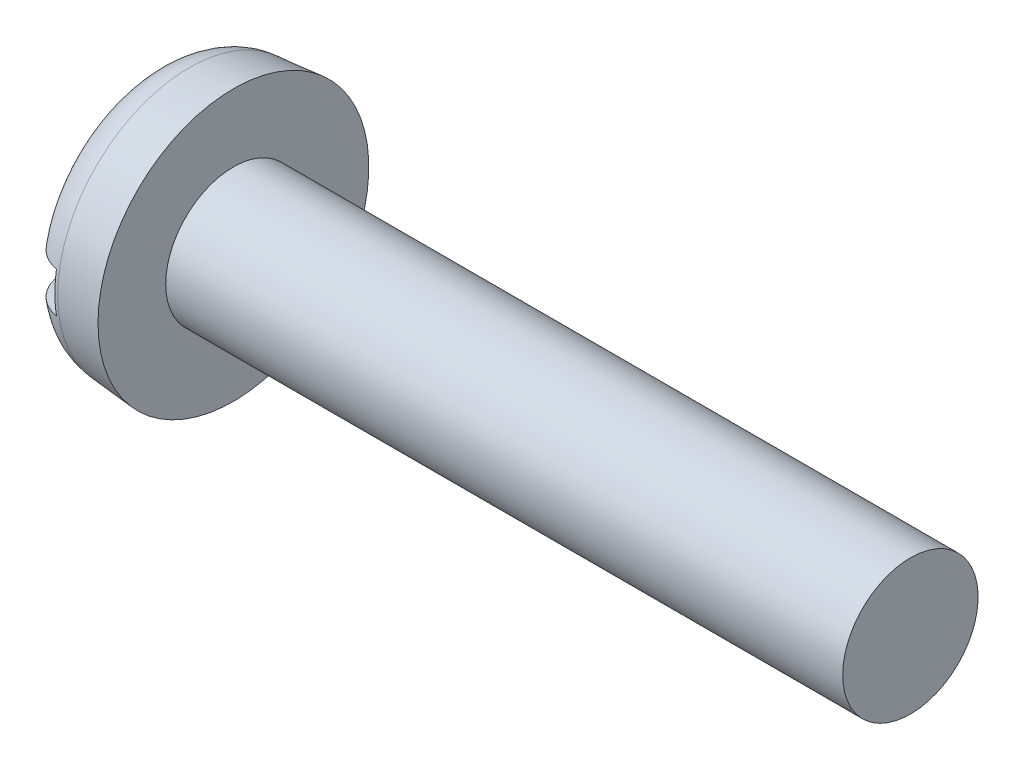
ISO-10303-21;
HEADER;
FILE_DESCRIPTION(('STEP AP214'),'2;1');
FILE_NAME('part.step','',(''),(''),'','','');
FILE_SCHEMA(('AUTOMOTIVE_DESIGN { 1 0 10303 214 1 1 1 1 }'));
ENDSEC;
DATA;
#1=APPLICATION_CONTEXT('core data for automotive mechanical design processes');
#2=APPLICATION_PROTOCOL_DEFINITION('international standard','automotive_design',2000,#1);
#3=PRODUCT_CONTEXT('',#1,'mechanical');
#4=PRODUCT('Part','Part','',(#3));
#5=PRODUCT_RELATED_PRODUCT_CATEGORY('part','',(#4));
#6=PRODUCT_DEFINITION_FORMATION('','',#4);
#7=PRODUCT_DEFINITION_CONTEXT('part definition',#1,'design');
#8=PRODUCT_DEFINITION('design','',#6,#7);
#9=PRODUCT_DEFINITION_SHAPE('','',#8);
#10=(LENGTH_UNIT() NAMED_UNIT(*) SI_UNIT(.MILLI.,.METRE.));
#11=(NAMED_UNIT(*) PLANE_ANGLE_UNIT() SI_UNIT($,.RADIAN.));
#12=(NAMED_UNIT(*) SI_UNIT($,.STERADIAN.) SOLID_ANGLE_UNIT());
#13=UNCERTAINTY_MEASURE_WITH_UNIT(LENGTH_MEASURE(1.E-05),#10,'distance_accuracy_value','');
#14=(GEOMETRIC_REPRESENTATION_CONTEXT(3) GLOBAL_UNCERTAINTY_ASSIGNED_CONTEXT((#13)) GLOBAL_UNIT_ASSIGNED_CONTEXT((#10,
#11,#12)) REPRESENTATION_CONTEXT('',''));
#15=CARTESIAN_POINT('',(0.,0.,0.));
#16=DIRECTION('',(0.,0.,1.));
#17=DIRECTION('',(1.,0.,0.));
#18=AXIS2_PLACEMENT_3D('',#15,#16,#17);
#19=CARTESIAN_POINT('',(0.,0.,0.));
#20=DIRECTION('',(-1.,0.,0.));
#21=DIRECTION('',(0.,0.,1.));
#22=AXIS2_PLACEMENT_3D('',#19,#20,#21);
#23=PLANE('',#22);
#24=DIRECTION('',(0.,0.,-1.));
#25=VECTOR('',#24,1.);
#26=CARTESIAN_POINT('',(0.,0.599999999999999,4.));
#27=LINE('',#26,#25);
#28=CARTESIAN_POINT('',(0.,0.599999999999999,2.62267277825956));
#29=VERTEX_POINT('',#28);
#30=CARTESIAN_POINT('',(0.,0.599999999999999,-2.62267277825956));
#31=VERTEX_POINT('',#30);
#32=EDGE_CURVE('E90',#29,#31,#27,.T.);
#33=ORIENTED_EDGE('',*,*,#32,.F.);
#34=CARTESIAN_POINT('',(0.,0.,0.));
#35=DIRECTION('',(-1.,0.,0.));
#36=DIRECTION('',(0.,0.,1.));
#37=AXIS2_PLACEMENT_3D('',#34,#35,#36);
#38=CIRCLE('',#37,2.69042979871687);
#39=EDGE_CURVE('E96',#29,#31,#38,.T.);
#40=ORIENTED_EDGE('',*,*,#39,.T.);
#41=EDGE_LOOP('',(#33,#40));
#42=FACE_BOUND('',#41,.T.);
#43=ADVANCED_FACE('F37',(#42),#23,.T.);
#44=CARTESIAN_POINT('',(-25.4,0.,0.));
#45=DIRECTION('',(-1.,0.,0.));
#46=DIRECTION('',(0.,0.,1.));
#47=AXIS2_PLACEMENT_3D('',#44,#45,#46);
#48=CYLINDRICAL_SURFACE('',#47,2.);
#49=CARTESIAN_POINT('',(22.4,0.,0.));
#50=DIRECTION('',(-1.,0.,0.));
#51=DIRECTION('',(0.,0.,1.));
#52=AXIS2_PLACEMENT_3D('',#49,#50,#51);
#53=CIRCLE('',#52,2.);
#54=CARTESIAN_POINT('',(22.4,0.,2.));
#55=VERTEX_POINT('',#54);
#56=EDGE_CURVE('E97',#55,#55,#53,.T.);
#57=ORIENTED_EDGE('',*,*,#56,.T.);
#58=EDGE_LOOP('',(#57));
#59=FACE_BOUND('',#58,.T.);
#60=CARTESIAN_POINT('',(2.4,0.,0.));
#61=DIRECTION('',(-1.,0.,0.));
#62=DIRECTION('',(0.,0.,1.));
#63=AXIS2_PLACEMENT_3D('',#60,#61,#62);
#64=CIRCLE('',#63,2.);
#65=CARTESIAN_POINT('',(2.4,0.,2.));
#66=VERTEX_POINT('',#65);
#67=EDGE_CURVE('E154',#66,#66,#64,.T.);
#68=ORIENTED_EDGE('',*,*,#67,.F.);
#69=EDGE_LOOP('',(#68));
#70=FACE_BOUND('',#69,.T.);
#71=ADVANCED_FACE('F142',(#59,#70),#48,.T.);
#72=CARTESIAN_POINT('',(22.4,2.,0.));
#73=DIRECTION('',(1.,0.,0.));
#74=DIRECTION('',(0.,0.,-1.));
#75=AXIS2_PLACEMENT_3D('',#72,#73,#74);
#76=PLANE('',#75);
#77=ORIENTED_EDGE('',*,*,#56,.F.);
#78=EDGE_LOOP('',(#77));
#79=FACE_BOUND('',#78,.T.);
#80=ADVANCED_FACE('F140',(#79),#76,.T.);
#81=DIRECTION('',(0.,0.,1.));
#82=VECTOR('',#81,1.);
#83=CARTESIAN_POINT('',(0.,-0.599999999999999,-4.));
#84=LINE('',#83,#82);
#85=CARTESIAN_POINT('',(0.,-0.6,-2.62267277825956));
#86=VERTEX_POINT('',#85);
#87=CARTESIAN_POINT('',(0.,-0.6,2.62267277825956));
#88=VERTEX_POINT('',#87);
#89=EDGE_CURVE('E81',#86,#88,#84,.T.);
#90=ORIENTED_EDGE('',*,*,#89,.F.);
#91=EDGE_CURVE('E88',#86,#88,#38,.T.);
#92=ORIENTED_EDGE('',*,*,#91,.T.);
#93=EDGE_LOOP('',(#90,#92));
#94=FACE_BOUND('',#93,.T.);
#95=ADVANCED_FACE('F87',(#94),#23,.T.);
#96=CARTESIAN_POINT('',(0.,0.,0.));
#97=DIRECTION('',(1.,0.,0.));
#98=DIRECTION('',(0.,0.,-1.));
#99=AXIS2_PLACEMENT_3D('',#96,#97,#98);
#100=CONICAL_SURFACE('',#99,3.79002720753778,0.0872664625997168);
#101=CARTESIAN_POINT('',(1.09541310870281,0.,0.));
#102=DIRECTION('',(-1.,0.,0.));
#103=DIRECTION('',(0.,0.,1.));
#104=AXIS2_PLACEMENT_3D('',#101,#102,#103);
#105=CIRCLE('',#104,3.88586343642697);
#106=CARTESIAN_POINT('',(1.09541310870281,0.,3.88586343642697));
#107=VERTEX_POINT('',#106);
#108=EDGE_CURVE('E100',#107,#107,#105,.F.);
#109=ORIENTED_EDGE('',*,*,#108,.T.);
#110=EDGE_LOOP('',(#109));
#111=FACE_BOUND('',#110,.T.);
#112=CARTESIAN_POINT('',(2.4,0.,0.));
#113=DIRECTION('',(-1.,0.,0.));
#114=DIRECTION('',(0.,0.,1.));
#115=AXIS2_PLACEMENT_3D('',#112,#113,#114);
#116=CIRCLE('',#115,4.);
#117=CARTESIAN_POINT('',(2.4,0.,4.));
#118=VERTEX_POINT('',#117);
#119=EDGE_CURVE('E102',#118,#118,#116,.T.);
#120=ORIENTED_EDGE('',*,*,#119,.T.);
#121=EDGE_LOOP('',(#120));
#122=FACE_BOUND('',#121,.T.);
#123=ADVANCED_FACE('F133',(#111,#122),#100,.T.);
#124=CARTESIAN_POINT('',(2.4,2.,0.));
#125=DIRECTION('',(-1.,0.,0.));
#126=DIRECTION('',(0.,0.,1.));
#127=AXIS2_PLACEMENT_3D('',#124,#125,#126);
#128=PLANE('',#127);
#129=ORIENTED_EDGE('',*,*,#119,.F.);
#130=EDGE_LOOP('',(#129));
#131=FACE_BOUND('',#130,.T.);
#132=ORIENTED_EDGE('',*,*,#67,.T.);
#133=EDGE_LOOP('',(#132));
#134=FACE_BOUND('',#133,.T.);
#135=ADVANCED_FACE('F129',(#131,#134),#128,.F.);
#136=CARTESIAN_POINT('',(1.2,0.,0.));
#137=DIRECTION('',(-1.,0.,0.));
#138=DIRECTION('',(0.,0.,1.));
#139=AXIS2_PLACEMENT_3D('',#136,#137,#138);
#140=TOROIDAL_SURFACE('',#139,2.69042979871687,1.2);
#141=CARTESIAN_POINT('',(0.555724322716202,0.599999999999999,-3.65387250266693));
#142=CARTESIAN_POINT('',(0.611863503349148,0.599999999999999,-3.69007442380863));
#143=CARTESIAN_POINT('',(0.671083729036184,0.599999999999999,-3.72158508732967));
#144=CARTESIAN_POINT('',(0.79401889727098,0.599999999999999,-3.77425118606527));
#145=CARTESIAN_POINT('',(0.85773880813834,0.599999999999999,-3.79539496352661));
#146=CARTESIAN_POINT('',(0.98781720318935,0.599999999999999,-3.82665867013959));
#147=CARTESIAN_POINT('',(1.05417498163634,0.599999999999999,-3.83678152753281));
#148=CARTESIAN_POINT('',(1.18763076317312,0.599999999999999,-3.8457038749108));
#149=CARTESIAN_POINT('',(1.25472858753784,0.599999999999999,-3.84450604157818));
#150=CARTESIAN_POINT('',(1.3875826750597,0.599999999999999,-3.83084960648641));
#151=CARTESIAN_POINT('',(1.45334209482657,0.599999999999999,-3.81842168881049));
#152=CARTESIAN_POINT('',(1.58184721835929,0.599999999999999,-3.78271705011504));
#153=CARTESIAN_POINT('',(1.64459283097848,0.599999999999999,-3.75944000121253));
#154=CARTESIAN_POINT('',(1.76539749147003,0.599999999999999,-3.70268381719218));
#155=CARTESIAN_POINT('',(1.82344949533768,0.599999999999999,-3.66918969543344));
#156=CARTESIAN_POINT('',(1.93315741055135,0.599999999999999,-3.59299631395384));
#157=CARTESIAN_POINT('',(1.98481318571468,0.599999999999999,-3.55029685829444));
#158=CARTESIAN_POINT('',(2.08067865855225,0.599999999999999,-3.45659366392883));
#159=CARTESIAN_POINT('',(2.12483195353351,0.599999999999999,-3.40553224175404));
#160=CARTESIAN_POINT('',(2.20406927284653,0.599999999999999,-3.2968041503142));
#161=CARTESIAN_POINT('',(2.23915285291393,0.599999999999999,-3.23913715768625));
#162=CARTESIAN_POINT('',(2.29977245801882,0.599999999999999,-3.11803251672383));
#163=CARTESIAN_POINT('',(2.32517621704533,0.599999999999999,-3.0545286928096));
#164=CARTESIAN_POINT('',(2.36518290369176,0.599999999999999,-2.92420898188477));
#165=CARTESIAN_POINT('',(2.37978492313438,0.599999999999999,-2.85739281688645));
#166=CARTESIAN_POINT('',(2.39809162762938,0.599999999999999,-2.720979108425));
#167=CARTESIAN_POINT('',(2.40158167515656,0.599999999999999,-2.65135279312089));
#168=CARTESIAN_POINT('',(2.39710334710588,0.599999999999999,-2.51247199114133));
#169=CARTESIAN_POINT('',(2.3891336132547,0.599999999999999,-2.44321754951888));
#170=CARTESIAN_POINT('',(2.36175648802687,0.599999999999999,-2.30533307084818));
#171=CARTESIAN_POINT('',(2.34208762383128,0.599999999999999,-2.23675493734534));
#172=CARTESIAN_POINT('',(2.29173579101746,0.599999999999999,-2.10376468944742));
#173=CARTESIAN_POINT('',(2.26105116503169,0.599999999999999,-2.03935320366391));
#174=CARTESIAN_POINT('',(2.18883893218808,0.599999999999999,-1.91526992868471));
#175=CARTESIAN_POINT('',(2.1471165056861,0.599999999999999,-1.85571135727383));
#176=CARTESIAN_POINT('',(2.05420440083136,0.599999999999999,-1.74447273219384));
#177=CARTESIAN_POINT('',(2.00301317756159,0.599999999999999,-1.69279396669781));
#178=CARTESIAN_POINT('',(1.89282670052909,0.599999999999999,-1.59935956728662));
#179=CARTESIAN_POINT('',(1.83388602838351,0.599999999999999,-1.55753977190406));
#180=CARTESIAN_POINT('',(1.70948185067936,0.599999999999999,-1.48508690767309));
#181=CARTESIAN_POINT('',(1.64402152569503,0.599999999999999,-1.45444841778766));
#182=CARTESIAN_POINT('',(1.51242704366611,0.599999999999999,-1.40732654963726));
#183=CARTESIAN_POINT('',(1.44654962286927,0.599999999999999,-1.39012852945816));
#184=CARTESIAN_POINT('',(1.31277581417209,0.599999999999999,-1.36804629048771));
#185=CARTESIAN_POINT('',(1.24488075040813,0.599999999999999,-1.36315416860763));
#186=CARTESIAN_POINT('',(1.11440042570839,0.599999999999999,-1.3658663857273));
#187=CARTESIAN_POINT('',(1.05179449572622,0.599999999999999,-1.37257162730299));
#188=CARTESIAN_POINT('',(0.928605963701139,0.599999999999999,-1.39641067429417));
#189=CARTESIAN_POINT('',(0.868023556260331,0.599999999999999,-1.41354547969186));
#190=CARTESIAN_POINT('',(0.750454112986128,0.599999999999999,-1.45742791668989));
#191=CARTESIAN_POINT('',(0.693467986386993,0.599999999999999,-1.48417796792157));
#192=CARTESIAN_POINT('',(0.584374021297146,0.599999999999999,-1.54623887256252));
#193=CARTESIAN_POINT('',(0.532267486891909,0.599999999999999,-1.58155200548116));
#194=CARTESIAN_POINT('',(0.430463804312328,0.599999999999999,-1.66242118254972));
#195=CARTESIAN_POINT('',(0.381204762276414,0.599999999999999,-1.70852877722299));
#196=CARTESIAN_POINT('',(0.29055833745708,0.599999999999999,-1.80792441857343));
#197=CARTESIAN_POINT('',(0.249173324572385,0.599999999999999,-1.8612146188283));
#198=CARTESIAN_POINT('',(0.172904651790317,0.599999999999999,-1.97708145352176));
#199=CARTESIAN_POINT('',(0.138582884910169,0.599999999999999,-2.04002893603062));
#200=CARTESIAN_POINT('',(0.080798182809496,0.599999999999999,-2.1707301566156));
#201=CARTESIAN_POINT('',(0.0573365375719272,0.599999999999999,-2.23848446455253));
#202=CARTESIAN_POINT('',(0.0217170532407087,0.599999999999999,-2.37805490458703));
#203=CARTESIAN_POINT('',(0.0097436232599614,0.599999999999999,-2.44991829166716));
#204=CARTESIAN_POINT('',(-0.00176444513011861,0.599999999999999,-2.59463581803834));
#205=CARTESIAN_POINT('',(-0.00130029533651892,0.599999999999999,-2.66748986011829));
#206=CARTESIAN_POINT('',(0.0120986503819629,0.599999999999999,-2.81089700328133));
#207=CARTESIAN_POINT('',(0.0248384172287086,0.599999999999999,-2.88146827005461));
#208=CARTESIAN_POINT('',(0.0622829833683372,0.599999999999999,-3.01938616537757));
#209=CARTESIAN_POINT('',(0.0869893908733674,0.599999999999999,-3.08673235916841));
#210=CARTESIAN_POINT('',(0.147034211618126,0.599999999999999,-3.21458941223347));
#211=CARTESIAN_POINT('',(0.182112327711018,0.599999999999999,-3.27522270884045));
#212=CARTESIAN_POINT('',(0.262129598224535,0.599999999999999,-3.38951376597318));
#213=CARTESIAN_POINT('',(0.3070551842768,0.599999999999999,-3.4431809643305));
#214=CARTESIAN_POINT('',(0.386487799342843,0.599999999999999,-3.52288800458272));
#215=CARTESIAN_POINT('',(0.41834969068785,0.599999999999999,-3.55161115154615));
#216=CARTESIAN_POINT('',(0.484959806371627,0.599999999999999,-3.60549063407478));
#217=CARTESIAN_POINT('',(0.519707998209091,0.599999999999999,-3.63064700979512));
#218=CARTESIAN_POINT('',(0.555724322716202,0.599999999999999,-3.65387250266693));
#219=B_SPLINE_CURVE_WITH_KNOTS('',3,(#141,#142,#143,#144,#145,#146,#147,#148,#149,#150,#151,
#152,#153,#154,#155,#156,#157,#158,#159,#160,#161,#162,#163,#164,#165,#166,#167,#168,#169,#170,
#171,#172,#173,#174,#175,#176,#177,#178,#179,#180,#181,#182,#183,#184,#185,#186,#187,#188,#189,
#190,#191,#192,#193,#194,#195,#196,#197,#198,#199,#200,#201,#202,#203,#204,#205,#206,#207,#208,
#209,#210,#211,#212,#213,#214,#215,#216,#217,#218),.UNSPECIFIED.,.T.,.F.,(4,2,2,2,2,2,2,2,2,2,2,
2,2,2,2,2,2,2,2,2,2,2,2,2,2,2,2,2,2,2,2,2,2,2,2,2,2,2,4),(0.,0.200243358042193,
0.400711379889785,0.601126124682394,0.801493484271112,1.00131502784498,1.20114261082702,
1.40126472663769,1.60139110253377,1.80296115176425,2.0045410726864,2.20878426043059,
2.4130446183676,2.62122723540005,2.82943452936059,3.04247992292746,3.25555738350953,
3.47268067713076,3.68983942761508,3.90554330044416,4.12114245410102,4.32430364002433,
4.52733431850815,4.71532091726602,4.90332554293979,5.09137751225207,5.27947959643383,
5.48102054944294,5.68262206594248,5.89671811278409,6.11083958378157,6.3283433209323,
6.54582586670679,6.75990916919646,6.97402125060133,7.18315981256428,7.39201200366259,
7.52048040814581,7.64894736620129),.UNSPECIFIED.);
#220=CARTESIAN_POINT('',(1.,0.599999999999999,-3.8268957965744));
#221=VERTEX_POINT('',#220);
#222=EDGE_CURVE('E11',#31,#221,#219,.T.);
#223=ORIENTED_EDGE('',*,*,#222,.F.);
#224=ORIENTED_EDGE('',*,*,#39,.F.);
#225=CARTESIAN_POINT('',(0.502169862220851,0.599999999999999,1.60576049010406));
#226=CARTESIAN_POINT('',(0.554195997313862,0.599999999999999,1.56606149455159));
#227=CARTESIAN_POINT('',(0.609396363460623,0.599999999999999,1.5304748769286));
#228=CARTESIAN_POINT('',(0.724919902387091,0.599999999999999,1.46881203211046));
#229=CARTESIAN_POINT('',(0.78524511775107,0.599999999999999,1.44273961907343));
#230=CARTESIAN_POINT('',(0.909667984670193,0.599999999999999,1.40122623383893));
#231=CARTESIAN_POINT('',(0.973775803970176,0.599999999999999,1.3858154785519));
#232=CARTESIAN_POINT('',(1.10369459691222,0.599999999999999,1.3665995768585));
#233=CARTESIAN_POINT('',(1.16950473399694,0.599999999999999,1.36278883524858));
#234=CARTESIAN_POINT('',(1.29767383646965,0.599999999999999,1.36688511316403));
#235=CARTESIAN_POINT('',(1.36005075920352,0.599999999999999,1.37425454422071));
#236=CARTESIAN_POINT('',(1.48268610691276,0.599999999999999,1.3993323887586));
#237=CARTESIAN_POINT('',(1.54294419279274,0.599999999999999,1.41704244922564));
#238=CARTESIAN_POINT('',(1.66002557964332,0.599999999999999,1.46205841215047));
#239=CARTESIAN_POINT('',(1.7168336415075,0.599999999999999,1.48940370493373));
#240=CARTESIAN_POINT('',(1.82548566793481,0.599999999999999,1.55261257751152));
#241=CARTESIAN_POINT('',(1.87732830279925,0.599999999999999,1.58847843013923));
#242=CARTESIAN_POINT('',(1.97854810073885,0.599999999999999,1.67047725503447));
#243=CARTESIAN_POINT('',(2.02747577991844,0.599999999999999,1.71716517805002));
#244=CARTESIAN_POINT('',(2.11736172612646,0.599999999999999,1.81767012158426));
#245=CARTESIAN_POINT('',(2.15831764012507,0.599999999999999,1.87148923916616));
#246=CARTESIAN_POINT('',(2.23355847729609,0.599999999999999,1.98831219691805));
#247=CARTESIAN_POINT('',(2.26728695159877,0.599999999999999,2.05167539430345));
#248=CARTESIAN_POINT('',(2.32380864360461,0.599999999999999,2.18310973260806));
#249=CARTESIAN_POINT('',(2.34660064211914,0.599999999999999,2.25118139745569));
#250=CARTESIAN_POINT('',(2.38078258384822,0.599999999999999,2.39118439023871));
#251=CARTESIAN_POINT('',(2.39200303273256,0.599999999999999,2.4631572729439));
#252=CARTESIAN_POINT('',(2.40199059202937,0.599999999999999,2.6079662551021));
#253=CARTESIAN_POINT('',(2.40075847641363,0.599999999999999,2.68080230062537));
#254=CARTESIAN_POINT('',(2.38584508891232,0.599999999999999,2.82400920244241));
#255=CARTESIAN_POINT('',(2.37236420661957,0.599999999999999,2.89440086492365));
#256=CARTESIAN_POINT('',(2.33348423020416,0.599999999999999,3.03181492890283));
#257=CARTESIAN_POINT('',(2.30808661124079,0.599999999999999,3.09883774628967));
#258=CARTESIAN_POINT('',(2.24675302663963,0.599999999999999,3.22591541456794));
#259=CARTESIAN_POINT('',(2.21108136601875,0.599999999999999,3.28609785077449));
#260=CARTESIAN_POINT('',(2.12994290339031,0.599999999999999,3.39945330034395));
#261=CARTESIAN_POINT('',(2.08447722978464,0.599999999999999,3.45262712005702));
#262=CARTESIAN_POINT('',(1.98604906833368,0.599999999999999,3.54932660445764));
#263=CARTESIAN_POINT('',(1.93325708463036,0.599999999999999,3.59302587972974));
#264=CARTESIAN_POINT('',(1.82099888889279,0.599999999999999,3.6707908054873));
#265=CARTESIAN_POINT('',(1.76153323011689,0.599999999999999,3.70485725372668));
#266=CARTESIAN_POINT('',(1.63851582614255,0.599999999999999,3.76190993768401));
#267=CARTESIAN_POINT('',(1.575032686327,0.599999999999999,3.78504416991699));
#268=CARTESIAN_POINT('',(1.44506693734693,0.599999999999999,3.82023372150754));
#269=CARTESIAN_POINT('',(1.37858447830049,0.599999999999999,3.83228959470095));
#270=CARTESIAN_POINT('',(1.2450532582328,0.599999999999999,3.84490952635778));
#271=CARTESIAN_POINT('',(1.17801273248922,0.599999999999999,3.84556087980825));
#272=CARTESIAN_POINT('',(1.04477855348305,0.599999999999999,3.83557645638729));
#273=CARTESIAN_POINT('',(0.97858488328406,0.599999999999999,3.82494090560255));
#274=CARTESIAN_POINT('',(0.849043854854766,0.599999999999999,3.79272986650908));
#275=CARTESIAN_POINT('',(0.785691580134227,0.599999999999999,3.77117413652505));
#276=CARTESIAN_POINT('',(0.663485962281916,0.599999999999999,3.71777208087242));
#277=CARTESIAN_POINT('',(0.604632647735712,0.599999999999999,3.68592568982557));
#278=CARTESIAN_POINT('',(0.492838198064014,0.599999999999999,3.61273559956574));
#279=CARTESIAN_POINT('',(0.439920778835699,0.599999999999999,3.57135568909521));
#280=CARTESIAN_POINT('',(0.341703003355961,0.599999999999999,3.48037671595362));
#281=CARTESIAN_POINT('',(0.296402912644844,0.599999999999999,3.4307773668723));
#282=CARTESIAN_POINT('',(0.214216637891039,0.599999999999999,3.32426975498639));
#283=CARTESIAN_POINT('',(0.177416196614051,0.599999999999999,3.26729535433983));
#284=CARTESIAN_POINT('',(0.113734280831437,0.599999999999999,3.14805291236019));
#285=CARTESIAN_POINT('',(0.0868534773827801,0.599999999999999,3.08578451324207));
#286=CARTESIAN_POINT('',(0.0432984038722909,0.599999999999999,2.95667993727193));
#287=CARTESIAN_POINT('',(0.0267920294226123,0.599999999999999,2.88978715259473));
#288=CARTESIAN_POINT('',(0.0049909085292307,0.599999999999999,2.75420476818608));
#289=CARTESIAN_POINT('',(-0.00030316416053212,0.599999999999999,2.68551506072751));
#290=CARTESIAN_POINT('',(0.000336723786950048,0.599999999999999,2.54672879728013));
#291=CARTESIAN_POINT('',(0.00651181958924709,0.599999999999999,2.47663338312466));
#292=CARTESIAN_POINT('',(0.0302683746539185,0.599999999999999,2.33838698246598));
#293=CARTESIAN_POINT('',(0.0478537668693282,0.599999999999999,2.27023667486996));
#294=CARTESIAN_POINT('',(0.0944025067670348,0.599999999999999,2.13614591022569));
#295=CARTESIAN_POINT('',(0.123623163920171,0.599999999999999,2.07029483559486));
#296=CARTESIAN_POINT('',(0.192559891589905,0.599999999999999,1.94438410371856));
#297=CARTESIAN_POINT('',(0.2322674757986,0.599999999999999,1.88431981704395));
#298=CARTESIAN_POINT('',(0.309450215947058,0.599999999999999,1.78645693170318));
#299=CARTESIAN_POINT('',(0.344782243066562,0.599999999999999,1.74694893515638));
#300=CARTESIAN_POINT('',(0.420107750519954,0.599999999999999,1.67265127145993));
#301=CARTESIAN_POINT('',(0.460101073867665,0.599999999999999,1.63786144549399));
#302=CARTESIAN_POINT('',(0.502169862220851,0.599999999999999,1.60576049010406));
#303=B_SPLINE_CURVE_WITH_KNOTS('',3,(#225,#226,#227,#228,#229,#230,#231,#232,#233,#234,#235,
#236,#237,#238,#239,#240,#241,#242,#243,#244,#245,#246,#247,#248,#249,#250,#251,#252,#253,#254,
#255,#256,#257,#258,#259,#260,#261,#262,#263,#264,#265,#266,#267,#268,#269,#270,#271,#272,#273,
#274,#275,#276,#277,#278,#279,#280,#281,#282,#283,#284,#285,#286,#287,#288,#289,#290,#291,#292,
#293,#294,#295,#296,#297,#298,#299,#300,#301,#302),.UNSPECIFIED.,.T.,.F.,(4,2,2,2,2,2,2,2,2,2,2,
2,2,2,2,2,2,2,2,2,2,2,2,2,2,2,2,2,2,2,2,2,2,2,2,2,2,2,4),(0.,0.196155115726593,
0.392388782089829,0.589176353707647,0.785868990857216,0.973398935304284,1.16095875640924,
1.34929442179896,1.53768038166965,1.73969106717026,1.94176129013925,2.15610790054282,
2.37047840056834,2.58794612071254,2.80540032453685,3.01935980487071,3.23329280638858,
3.44215048351511,3.65098411028846,3.85558774053007,4.06017442131495,4.26190596735446,
4.4636274277632,4.66380414650815,4.86397685561164,5.06378867076654,5.26360175538361,
5.46418668322599,5.66477860201614,5.8673133607554,6.0698618183271,6.27560910997272,
6.48136876474581,6.69150348637297,6.90171067669911,7.11685054551971,7.3318168479036,
7.4904349324249,7.64904767644565),.UNSPECIFIED.);
#304=CARTESIAN_POINT('',(1.,0.599999999999999,3.8268957965744));
#305=VERTEX_POINT('',#304);
#306=EDGE_CURVE('E114',#305,#29,#303,.T.);
#307=ORIENTED_EDGE('',*,*,#306,.F.);
#308=CARTESIAN_POINT('',(1.,0.,0.));
#309=DIRECTION('',(-1.,0.,0.));
#310=DIRECTION('',(0.,0.,1.));
#311=AXIS2_PLACEMENT_3D('',#308,#309,#310);
#312=CIRCLE('',#311,3.8736457553368);
#313=CARTESIAN_POINT('',(1.,-0.600000000000001,3.8268957965744));
#314=VERTEX_POINT('',#313);
#315=EDGE_CURVE('E108',#305,#314,#312,.F.);
#316=ORIENTED_EDGE('',*,*,#315,.T.);
#317=CARTESIAN_POINT('',(0.502169862220851,-0.6,1.60576049010406));
#318=CARTESIAN_POINT('',(0.445187804888271,-0.6,1.64924594165658));
#319=CARTESIAN_POINT('',(0.391933472244661,-0.6,1.69773094165443));
#320=CARTESIAN_POINT('',(0.294269964991248,-0.6,1.80302002506522));
#321=CARTESIAN_POINT('',(0.249878364602913,-0.6,1.85984025736593));
#322=CARTESIAN_POINT('',(0.171206816911496,-0.6,1.97997650896743));
#323=CARTESIAN_POINT('',(0.136911216950073,-0.6,2.04328226558821));
#324=CARTESIAN_POINT('',(0.079302273944053,-0.6,2.17467115825739));
#325=CARTESIAN_POINT('',(0.0559837935010256,-0.6,2.24275204232382));
#326=CARTESIAN_POINT('',(0.0208174640704712,-0.6,2.38269571187546));
#327=CARTESIAN_POINT('',(0.00911087109212244,-0.6,2.45459412123746));
#328=CARTESIAN_POINT('',(-0.00186064335918997,-0.6,2.59934603493694));
#329=CARTESIAN_POINT('',(-0.00112505843238442,-0.6,2.67219957802801));
#330=CARTESIAN_POINT('',(0.0128115643235184,-0.6,2.81554909630781));
#331=CARTESIAN_POINT('',(0.0258159222928432,-0.6,2.88606413178172));
#332=CARTESIAN_POINT('',(0.063770964305813,-0.6,3.02380438364728));
#333=CARTESIAN_POINT('',(0.0887200321456668,-0.6,3.09103004375874));
#334=CARTESIAN_POINT('',(0.149209632118778,-0.6,3.21858311967668));
#335=CARTESIAN_POINT('',(0.184484980441036,-0.6,3.279036311944));
#336=CARTESIAN_POINT('',(0.264884211769197,-0.6,3.39299625173735));
#337=CARTESIAN_POINT('',(0.310006943660719,-0.6,3.44650381001148));
#338=CARTESIAN_POINT('',(0.407814256142235,-0.6,3.54391044326939));
#339=CARTESIAN_POINT('',(0.460326097945837,-0.600000000000001,3.58798302565714));
#340=CARTESIAN_POINT('',(0.572092607735509,-0.600000000000001,3.66653552056079));
#341=CARTESIAN_POINT('',(0.631346721547285,-0.600000000000001,3.70101622067049));
#342=CARTESIAN_POINT('',(0.754010325129881,-0.600000000000001,3.75891555010685));
#343=CARTESIAN_POINT('',(0.817349533431292,-0.600000000000001,3.78248314425441));
#344=CARTESIAN_POINT('',(0.947103098726598,-0.600000000000001,3.8185560798249));
#345=CARTESIAN_POINT('',(1.01351729826215,-0.600000000000001,3.831061987016));
#346=CARTESIAN_POINT('',(1.14698149286261,-0.600000000000001,3.84458065279169));
#347=CARTESIAN_POINT('',(1.21402252532342,-0.600000000000001,3.84568204518038));
#348=CARTESIAN_POINT('',(1.34733322601533,-0.600000000000001,3.8365898614374));
#349=CARTESIAN_POINT('',(1.41360291013608,-0.600000000000001,3.82639651839323));
#350=CARTESIAN_POINT('',(1.54336099970613,-0.600000000000001,3.79504996018554));
#351=CARTESIAN_POINT('',(1.60685449108947,-0.600000000000001,3.77391778279252));
#352=CARTESIAN_POINT('',(1.72941080869112,-0.600000000000001,3.72133205011964));
#353=CARTESIAN_POINT('',(1.78847360678717,-0.600000000000001,3.68987842933487));
#354=CARTESIAN_POINT('',(1.90074291633249,-0.600000000000001,3.61743745397878));
#355=CARTESIAN_POINT('',(1.95392663622623,-0.6,3.57641479035515));
#356=CARTESIAN_POINT('',(2.05273165376454,-0.6,3.48610012879553));
#357=CARTESIAN_POINT('',(2.09835269571048,-0.6,3.43680785137231));
#358=CARTESIAN_POINT('',(2.18122399483412,-0.6,3.33086486560888));
#359=CARTESIAN_POINT('',(2.21838996863528,-0.6,3.27414825375617));
#360=CARTESIAN_POINT('',(2.28283903515168,-0.6,3.15535714127581));
#361=CARTESIAN_POINT('',(2.31012151068743,-0.6,3.09328230635113));
#362=CARTESIAN_POINT('',(2.35450773657946,-0.6,2.9645074208392));
#363=CARTESIAN_POINT('',(2.37144545944321,-0.6,2.89775017739668));
#364=CARTESIAN_POINT('',(2.39412527486081,-0.6,2.76236351234964));
#365=CARTESIAN_POINT('',(2.39986625911194,-0.6,2.69373390609206));
#366=CARTESIAN_POINT('',(2.40013189223505,-0.6,2.55499487260784));
#367=CARTESIAN_POINT('',(2.39441545685642,-0.6,2.48488500789735));
#368=CARTESIAN_POINT('',(2.37157048783369,-0.6,2.34655110946443));
#369=CARTESIAN_POINT('',(2.35444050657074,-0.6,2.27832731610218));
#370=CARTESIAN_POINT('',(2.30880229882983,-0.6,2.14403189318753));
#371=CARTESIAN_POINT('',(2.28004015974487,-0.6,2.07804649170322));
#372=CARTESIAN_POINT('',(2.21198205602267,-0.6,1.95173941466225));
#373=CARTESIAN_POINT('',(2.17268418380821,-0.6,1.89141876742706));
#374=CARTESIAN_POINT('',(2.08404278693468,-0.6,1.77746904231949));
#375=CARTESIAN_POINT('',(2.03458266512073,-0.6,1.72393048027324));
#376=CARTESIAN_POINT('',(1.92716812913543,-0.6,1.62615004135948));
#377=CARTESIAN_POINT('',(1.86921365748267,-0.6,1.58190822740815));
#378=CARTESIAN_POINT('',(1.74788146667673,-0.6,1.50544361430848));
#379=CARTESIAN_POINT('',(1.68467867350212,-0.6,1.47294432570408));
#380=CARTESIAN_POINT('',(1.55342236253629,-0.6,1.41999907852413));
#381=CARTESIAN_POINT('',(1.48537275831152,-0.6,1.399543516172));
#382=CARTESIAN_POINT('',(1.35177681310789,-0.6,1.37290195775097));
#383=CARTESIAN_POINT('',(1.28641871377424,-0.6,1.36577077696137));
#384=CARTESIAN_POINT('',(1.15546768716647,-0.6,1.36327728846172));
#385=CARTESIAN_POINT('',(1.0898747678577,-0.6,1.36791458525973));
#386=CARTESIAN_POINT('',(0.963980829675207,-0.6,1.38812170220064));
#387=CARTESIAN_POINT('',(0.903583160312778,-0.6,1.40310206249021));
#388=CARTESIAN_POINT('',(0.786066139359773,-0.6,1.44262683450413));
#389=CARTESIAN_POINT('',(0.728943446904451,-0.6,1.46716129333266));
#390=CARTESIAN_POINT('',(0.64397073409987,-0.6,1.51179271406244));
#391=CARTESIAN_POINT('',(0.614516537621207,-0.6,1.5289173804088));
#392=CARTESIAN_POINT('',(0.557151177094441,-0.6,1.56557223152523));
#393=CARTESIAN_POINT('',(0.529239875819423,-0.6,1.58510220186438));
#394=CARTESIAN_POINT('',(0.502169862220851,-0.6,1.60576049010406));
#395=B_SPLINE_CURVE_WITH_KNOTS('',3,(#317,#318,#319,#320,#321,#322,#323,#324,#325,#326,#327,
#328,#329,#330,#331,#332,#333,#334,#335,#336,#337,#338,#339,#340,#341,#342,#343,#344,#345,#346,
#347,#348,#349,#350,#351,#352,#353,#354,#355,#356,#357,#358,#359,#360,#361,#362,#363,#364,#365,
#366,#367,#368,#369,#370,#371,#372,#373,#374,#375,#376,#377,#378,#379,#380,#381,#382,#383,#384,
#385,#386,#387,#388,#389,#390,#391,#392,#393,#394),.UNSPECIFIED.,.T.,.F.,(4,2,2,2,2,2,2,2,2,2,2,
2,2,2,2,2,2,2,2,2,2,2,2,2,2,2,2,2,2,2,2,2,2,2,2,2,2,2,4),(0.,0.214909289205808,
0.430240586992668,0.645236259197135,0.860131211059869,1.07760937806708,1.29509639651167,
1.50915509475584,1.72318483752514,1.93213930393833,2.14106935759512,2.34574393187552,
2.55040169527001,2.75217693348344,2.95394185097358,3.15413750044276,3.35432901858581,
3.5541369472984,3.75394614411415,3.95450462256355,4.15506988063212,4.35755447809037,
4.56005171761164,4.76571892637877,4.97140649196309,5.1814675155355,5.39155518693494,
5.60650016749508,5.82148409184524,6.0390882009346,6.25669378262228,6.46877775971814,
6.68069238927503,6.87690174113158,7.07310449925608,7.25895986926916,7.44462214185234,
7.5467264876591,7.64882173752531),.UNSPECIFIED.);
#396=EDGE_CURVE('E95',#88,#314,#395,.T.);
#397=ORIENTED_EDGE('',*,*,#396,.F.);
#398=ORIENTED_EDGE('',*,*,#91,.F.);
#399=CARTESIAN_POINT('',(0.555724322716202,-0.599999999999999,-3.65387250266693));
#400=CARTESIAN_POINT('',(0.498734487107693,-0.599999999999999,-3.61711459061981));
#401=CARTESIAN_POINT('',(0.444834286556899,-0.6,-3.57546537661762));
#402=CARTESIAN_POINT('',(0.344782235470992,-0.6,-3.48363725362616));
#403=CARTESIAN_POINT('',(0.298641048601753,-0.6,-3.43344679333961));
#404=CARTESIAN_POINT('',(0.215461505379157,-0.6,-3.32610544095163));
#405=CARTESIAN_POINT('',(0.178413027077163,-0.6,-3.2689623954354));
#406=CARTESIAN_POINT('',(0.114320536316776,-0.6,-3.14934530577007));
#407=CARTESIAN_POINT('',(0.087273975571947,-0.6,-3.08687262450341));
#408=CARTESIAN_POINT('',(0.0435456153310547,-0.6,-2.95757076777015));
#409=CARTESIAN_POINT('',(0.0269912885242556,-0.6,-2.89069851811573));
#410=CARTESIAN_POINT('',(0.00508983773089982,-0.6,-2.75514352003498));
#411=CARTESIAN_POINT('',(-0.000255715967125226,-0.6,-2.68646051929679));
#412=CARTESIAN_POINT('',(0.000280181928882534,-0.6,-2.54767232604025));
#413=CARTESIAN_POINT('',(0.00640389318546278,-0.6,-2.47756809367081));
#414=CARTESIAN_POINT('',(0.030057369450734,-0.6,-2.33931217858881));
#415=CARTESIAN_POINT('',(0.0475885787351316,-0.6,-2.27116074425614));
#416=CARTESIAN_POINT('',(0.0940220796310567,-0.6,-2.13708014435867));
#417=CARTESIAN_POINT('',(0.123177459871497,-0.6,-2.07123856329926));
#418=CARTESIAN_POINT('',(0.191996840461179,-0.6,-1.94528477297759));
#419=CARTESIAN_POINT('',(0.23166272102536,-0.6,-1.88517359144066));
#420=CARTESIAN_POINT('',(0.320994420183015,-0.6,-1.77173274709496));
#421=CARTESIAN_POINT('',(0.370772688558791,-0.6,-1.71849145219619));
#422=CARTESIAN_POINT('',(0.478774924200321,-0.6,-1.62136628413147));
#423=CARTESIAN_POINT('',(0.53699882964131,-0.6,-1.57748234247251));
#424=CARTESIAN_POINT('',(0.658746751801836,-0.6,-1.50181934669774));
#425=CARTESIAN_POINT('',(0.722091015372935,-0.6,-1.46975218583295));
#426=CARTESIAN_POINT('',(0.85355413934977,-0.6,-1.41769610273586));
#427=CARTESIAN_POINT('',(0.9216693571574,-0.6,-1.39769807558827));
#428=CARTESIAN_POINT('',(1.05528073226624,-0.6,-1.37194849542814));
#429=CARTESIAN_POINT('',(1.12059402770935,-0.6,-1.36524668580602));
#430=CARTESIAN_POINT('',(1.2513608306894,-0.6,-1.36358106378588));
#431=CARTESIAN_POINT('',(1.31681429025449,-0.6,-1.36861372862818));
#432=CARTESIAN_POINT('',(1.44243637650999,-0.6,-1.3895462531385));
#433=CARTESIAN_POINT('',(1.50270294174111,-0.6,-1.40486826144982));
#434=CARTESIAN_POINT('',(1.61996472065852,-0.6,-1.44504162049085));
#435=CARTESIAN_POINT('',(1.67695924640292,-0.6,-1.46989496679689));
#436=CARTESIAN_POINT('',(1.78847236469706,-0.6,-1.52925603648689));
#437=CARTESIAN_POINT('',(1.8428136789453,-0.6,-1.56409575480434));
#438=CARTESIAN_POINT('',(1.94542643684322,-0.6,-1.64178505433469));
#439=CARTESIAN_POINT('',(1.99369605530105,-0.6,-1.68463703450677));
#440=CARTESIAN_POINT('',(2.08661844967249,-0.6,-1.78069023089826));
#441=CARTESIAN_POINT('',(2.13071333528421,-0.6,-1.83443193970511));
#442=CARTESIAN_POINT('',(2.20971293722223,-0.6,-1.94829602924916));
#443=CARTESIAN_POINT('',(2.24461542871553,-0.6,-2.00841994974035));
#444=CARTESIAN_POINT('',(2.30564498113053,-0.6,-2.13620099236755));
#445=CARTESIAN_POINT('',(2.33132647228141,-0.6,-2.20407160700881));
#446=CARTESIAN_POINT('',(2.37093013901125,-0.6,-2.34316607329935));
#447=CARTESIAN_POINT('',(2.38485194511913,-0.6,-2.41439003023123));
#448=CARTESIAN_POINT('',(2.40040871681576,-0.6,-2.55814530959875));
#449=CARTESIAN_POINT('',(2.4020489044675,-0.6,-2.63067606324165));
#450=CARTESIAN_POINT('',(2.39285255646216,-0.6,-2.77494594310655));
#451=CARTESIAN_POINT('',(2.38201725023568,-0.6,-2.84668514663064));
#452=CARTESIAN_POINT('',(2.34840555740405,-0.6,-2.98570551202485));
#453=CARTESIAN_POINT('',(2.32588655332661,-0.6,-3.05304886882671));
#454=CARTESIAN_POINT('',(2.26959715690888,-0.6,-3.18285922328742));
#455=CARTESIAN_POINT('',(2.23582815934717,-0.6,-3.24532682425997));
#456=CARTESIAN_POINT('',(2.15885364636982,-0.6,-3.3620818964694));
#457=CARTESIAN_POINT('',(2.11588409914039,-0.6,-3.41652497858749));
#458=CARTESIAN_POINT('',(2.02126247127927,-0.6,-3.51725700707964));
#459=CARTESIAN_POINT('',(1.96961127326843,-0.599999999999999,-3.56354678138178));
#460=CARTESIAN_POINT('',(1.86010105975079,-0.599999999999999,-3.64579800718517));
#461=CARTESIAN_POINT('',(1.80236971924135,-0.599999999999999,-3.68192950988134));
#462=CARTESIAN_POINT('',(1.681608684283,-0.599999999999999,-3.74385467152818));
#463=CARTESIAN_POINT('',(1.61857958143153,-0.599999999999999,-3.76964948291949));
#464=CARTESIAN_POINT('',(1.48979929809101,-0.599999999999999,-3.80988187775508));
#465=CARTESIAN_POINT('',(1.42408810681578,-0.599999999999999,-3.82444755898968));
#466=CARTESIAN_POINT('',(1.29113110330166,-0.599999999999999,-3.84227724040414));
#467=CARTESIAN_POINT('',(1.22388494790151,-0.599999999999999,-3.84553868796567));
#468=CARTESIAN_POINT('',(1.09014166318395,-0.599999999999999,-3.84067025026788));
#469=CARTESIAN_POINT('',(1.02364248270528,-0.599999999999999,-3.83259555770782));
#470=CARTESIAN_POINT('',(0.893005358162851,-0.599999999999999,-3.80539646556702));
#471=CARTESIAN_POINT('',(0.828864495693135,-0.599999999999999,-3.78628624798273));
#472=CARTESIAN_POINT('',(0.729946544207731,-0.599999999999999,-3.74751823217336));
#473=CARTESIAN_POINT('',(0.693813005481406,-0.599999999999999,-3.73122751067556));
#474=CARTESIAN_POINT('',(0.62334316843107,-0.599999999999999,-3.69513810064685));
#475=CARTESIAN_POINT('',(0.589006861261743,-0.599999999999999,-3.67533942938289));
#476=CARTESIAN_POINT('',(0.555724322716202,-0.599999999999999,-3.65387250266693));
#477=B_SPLINE_CURVE_WITH_KNOTS('',3,(#399,#400,#401,#402,#403,#404,#405,#406,#407,#408,#409,
#410,#411,#412,#413,#414,#415,#416,#417,#418,#419,#420,#421,#422,#423,#424,#425,#426,#427,#428,
#429,#430,#431,#432,#433,#434,#435,#436,#437,#438,#439,#440,#441,#442,#443,#444,#445,#446,#447,
#448,#449,#450,#451,#452,#453,#454,#455,#456,#457,#458,#459,#460,#461,#462,#463,#464,#465,#466,
#467,#468,#469,#470,#471,#472,#473,#474,#475,#476),.UNSPECIFIED.,.T.,.F.,(4,2,2,2,2,2,2,2,2,2,2,
2,2,2,2,2,2,2,2,2,2,2,2,2,2,2,2,2,2,2,2,2,2,2,2,2,2,2,4),(0.,0.203300257815017,
0.406877679045309,0.610227440613545,0.813525357019622,1.01924809480235,1.2249996513037,
1.43514627519852,1.64531951042678,1.86034319937992,2.07540537974668,2.29300466722379,
2.51060236188496,2.72247496504447,2.93418753175195,3.13012961045541,3.32601287374477,
3.51172484413671,3.69747571829216,3.89030945854258,4.08320102805767,4.29082627920118,
4.49850173575233,4.71517227306082,4.93184961756871,5.14843482706768,5.36499869442993,
5.57698255384774,5.78894014119876,5.99600218003297,6.20304318060416,6.40637800583236,
6.60969015489207,6.81064719188886,7.01164960420462,7.21167677523292,7.4114474572025,
7.53017708503141,7.64890612846169),.UNSPECIFIED.);
#478=CARTESIAN_POINT('',(1.,-0.599999999999999,-3.8268957965744));
#479=VERTEX_POINT('',#478);
#480=EDGE_CURVE('E49',#479,#86,#477,.T.);
#481=ORIENTED_EDGE('',*,*,#480,.F.);
#482=EDGE_CURVE('E61',#479,#221,#312,.F.);
#483=ORIENTED_EDGE('',*,*,#482,.T.);
#484=EDGE_LOOP('',(#223,#224,#307,#316,#397,#398,#481,#483));
#485=FACE_BOUND('',#484,.T.);
#486=ORIENTED_EDGE('',*,*,#108,.F.);
#487=EDGE_LOOP('',(#486));
#488=FACE_BOUND('',#487,.T.);
#489=ADVANCED_FACE('F39',(#485,#488),#140,.T.);
#490=CARTESIAN_POINT('',(1.,0.599999999999999,4.));
#491=DIRECTION('',(0.,1.,0.));
#492=DIRECTION('',(0.,0.,1.));
#493=AXIS2_PLACEMENT_3D('',#490,#491,#492);
#494=PLANE('',#493);
#495=ORIENTED_EDGE('',*,*,#222,.T.);
#496=DIRECTION('',(0.,0.,-1.));
#497=VECTOR('',#496,1.);
#498=CARTESIAN_POINT('',(1.,0.599999999999999,4.));
#499=LINE('',#498,#497);
#500=EDGE_CURVE('E89',#305,#221,#499,.T.);
#501=ORIENTED_EDGE('',*,*,#500,.F.);
#502=ORIENTED_EDGE('',*,*,#306,.T.);
#503=ORIENTED_EDGE('',*,*,#32,.T.);
#504=EDGE_LOOP('',(#495,#501,#502,#503));
#505=FACE_BOUND('',#504,.T.);
#506=ADVANCED_FACE('F121',(#505),#494,.F.);
#507=CARTESIAN_POINT('',(1.,-0.599999999999999,-4.));
#508=DIRECTION('',(0.,-1.,0.));
#509=DIRECTION('',(0.,0.,-1.));
#510=AXIS2_PLACEMENT_3D('',#507,#508,#509);
#511=PLANE('',#510);
#512=ORIENTED_EDGE('',*,*,#480,.T.);
#513=ORIENTED_EDGE('',*,*,#89,.T.);
#514=ORIENTED_EDGE('',*,*,#396,.T.);
#515=DIRECTION('',(0.,0.,1.));
#516=VECTOR('',#515,1.);
#517=CARTESIAN_POINT('',(1.,-0.599999999999999,-4.));
#518=LINE('',#517,#516);
#519=EDGE_CURVE('E56',#479,#314,#518,.T.);
#520=ORIENTED_EDGE('',*,*,#519,.F.);
#521=EDGE_LOOP('',(#512,#513,#514,#520));
#522=FACE_BOUND('',#521,.T.);
#523=ADVANCED_FACE('F80',(#522),#511,.F.);
#524=CARTESIAN_POINT('',(1.,0.599999999999999,-4.));
#525=DIRECTION('',(-1.,0.,0.));
#526=DIRECTION('',(0.,0.,1.));
#527=AXIS2_PLACEMENT_3D('',#524,#525,#526);
#528=PLANE('',#527);
#529=ORIENTED_EDGE('',*,*,#519,.T.);
#530=ORIENTED_EDGE('',*,*,#315,.F.);
#531=ORIENTED_EDGE('',*,*,#500,.T.);
#532=ORIENTED_EDGE('',*,*,#482,.F.);
#533=EDGE_LOOP('',(#529,#530,#531,#532));
#534=FACE_BOUND('',#533,.T.);
#535=ADVANCED_FACE('F120',(#534),#528,.T.);
#536=CLOSED_SHELL('',(#43,#71,#80,#95,#123,#135,#489,#506,#523,#535));
#537=MANIFOLD_SOLID_BREP('B2',#536);
#538=ADVANCED_BREP_SHAPE_REPRESENTATION('',(#18,#537),#14);
#539=SHAPE_DEFINITION_REPRESENTATION(#9,#538);
ENDSEC;
END-ISO-10303-21;
